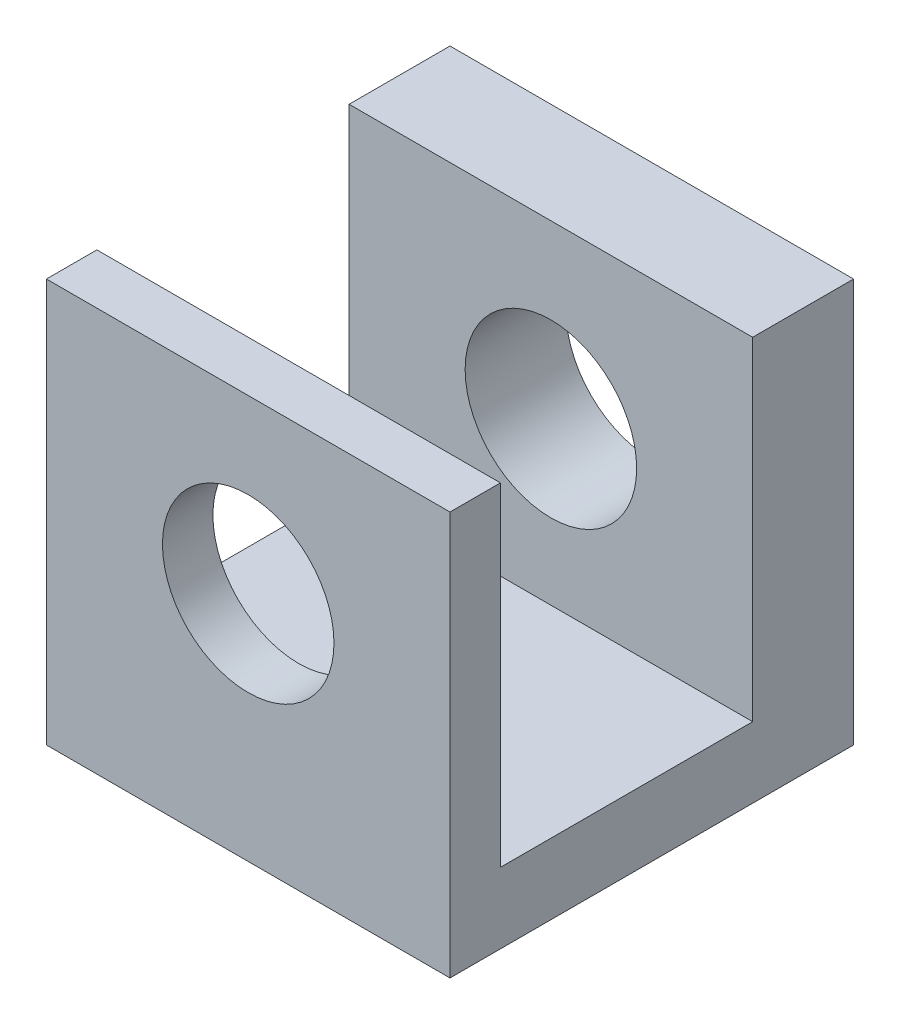
ISO-10303-21;
HEADER;
FILE_DESCRIPTION(('STEP AP214'),'2;1');
FILE_NAME('part.step','',(''),(''),'','','');
FILE_SCHEMA(('AUTOMOTIVE_DESIGN { 1 0 10303 214 1 1 1 1 }'));
ENDSEC;
DATA;
#1=APPLICATION_CONTEXT('core data for automotive mechanical design processes');
#2=APPLICATION_PROTOCOL_DEFINITION('international standard','automotive_design',2000,#1);
#3=PRODUCT_CONTEXT('',#1,'mechanical');
#4=PRODUCT('Part','Part','',(#3));
#5=PRODUCT_RELATED_PRODUCT_CATEGORY('part','',(#4));
#6=PRODUCT_DEFINITION_FORMATION('','',#4);
#7=PRODUCT_DEFINITION_CONTEXT('part definition',#1,'design');
#8=PRODUCT_DEFINITION('design','',#6,#7);
#9=PRODUCT_DEFINITION_SHAPE('','',#8);
#10=(LENGTH_UNIT() NAMED_UNIT(*) SI_UNIT(.MILLI.,.METRE.));
#11=(NAMED_UNIT(*) PLANE_ANGLE_UNIT() SI_UNIT($,.RADIAN.));
#12=(NAMED_UNIT(*) SI_UNIT($,.STERADIAN.) SOLID_ANGLE_UNIT());
#13=UNCERTAINTY_MEASURE_WITH_UNIT(LENGTH_MEASURE(1.E-05),#10,'distance_accuracy_value','');
#14=(GEOMETRIC_REPRESENTATION_CONTEXT(3) GLOBAL_UNCERTAINTY_ASSIGNED_CONTEXT((#13)) GLOBAL_UNIT_ASSIGNED_CONTEXT((#10,
#11,#12)) REPRESENTATION_CONTEXT('',''));
#15=CARTESIAN_POINT('',(0.,0.,0.));
#16=DIRECTION('',(0.,0.,1.));
#17=DIRECTION('',(1.,0.,0.));
#18=AXIS2_PLACEMENT_3D('',#15,#16,#17);
#19=CARTESIAN_POINT('',(20.,20.,-40.));
#20=DIRECTION('',(0.,1.,0.));
#21=DIRECTION('',(-1.,0.,0.));
#22=AXIS2_PLACEMENT_3D('',#19,#20,#21);
#23=PLANE('',#22);
#24=DIRECTION('',(1.,0.,0.));
#25=VECTOR('',#24,1.);
#26=CARTESIAN_POINT('',(-42.5,20.,-5.));
#27=LINE('',#26,#25);
#28=CARTESIAN_POINT('',(-20.,20.,-5.));
#29=VERTEX_POINT('',#28);
#30=CARTESIAN_POINT('',(20.,20.,-5.));
#31=VERTEX_POINT('',#30);
#32=EDGE_CURVE('E136',#29,#31,#27,.T.);
#33=ORIENTED_EDGE('',*,*,#32,.F.);
#34=DIRECTION('',(0.,0.,1.));
#35=VECTOR('',#34,1.);
#36=CARTESIAN_POINT('',(-20.,20.,-40.));
#37=LINE('',#36,#35);
#38=CARTESIAN_POINT('',(-20.,20.,0.));
#39=VERTEX_POINT('',#38);
#40=EDGE_CURVE('E43',#29,#39,#37,.T.);
#41=ORIENTED_EDGE('',*,*,#40,.T.);
#42=DIRECTION('',(-1.,0.,0.));
#43=VECTOR('',#42,1.);
#44=CARTESIAN_POINT('',(20.,20.,0.));
#45=LINE('',#44,#43);
#46=CARTESIAN_POINT('',(20.,20.,0.));
#47=VERTEX_POINT('',#46);
#48=EDGE_CURVE('E148',#47,#39,#45,.T.);
#49=ORIENTED_EDGE('',*,*,#48,.F.);
#50=DIRECTION('',(0.,0.,1.));
#51=VECTOR('',#50,1.);
#52=CARTESIAN_POINT('',(20.,20.,-40.));
#53=LINE('',#52,#51);
#54=EDGE_CURVE('E166',#31,#47,#53,.T.);
#55=ORIENTED_EDGE('',*,*,#54,.F.);
#56=EDGE_LOOP('',(#33,#41,#49,#55));
#57=FACE_BOUND('',#56,.T.);
#58=ADVANCED_FACE('F34',(#57),#23,.T.);
#59=CARTESIAN_POINT('',(-20.,-20.,-40.));
#60=DIRECTION('',(-1.,0.,0.));
#61=DIRECTION('',(0.,0.,1.));
#62=AXIS2_PLACEMENT_3D('',#59,#60,#61);
#63=PLANE('',#62);
#64=DIRECTION('',(0.,1.,0.));
#65=VECTOR('',#64,1.);
#66=CARTESIAN_POINT('',(-20.,-20.,-5.));
#67=LINE('',#66,#65);
#68=CARTESIAN_POINT('',(-20.,-13.,-5.));
#69=VERTEX_POINT('',#68);
#70=EDGE_CURVE('E142',#69,#29,#67,.T.);
#71=ORIENTED_EDGE('',*,*,#70,.F.);
#72=DIRECTION('',(0.,0.,1.));
#73=VECTOR('',#72,1.);
#74=CARTESIAN_POINT('',(-20.,-13.,-40.));
#75=LINE('',#74,#73);
#76=CARTESIAN_POINT('',(-20.,-13.,-30.));
#77=VERTEX_POINT('',#76);
#78=EDGE_CURVE('E138',#77,#69,#75,.T.);
#79=ORIENTED_EDGE('',*,*,#78,.F.);
#80=DIRECTION('',(0.,-1.,0.));
#81=VECTOR('',#80,1.);
#82=CARTESIAN_POINT('',(-20.,-20.,-30.));
#83=LINE('',#82,#81);
#84=CARTESIAN_POINT('',(-20.,20.,-30.));
#85=VERTEX_POINT('',#84);
#86=EDGE_CURVE('E117',#85,#77,#83,.T.);
#87=ORIENTED_EDGE('',*,*,#86,.F.);
#88=CARTESIAN_POINT('',(-20.,20.,-40.));
#89=VERTEX_POINT('',#88);
#90=EDGE_CURVE('E11',#89,#85,#37,.T.);
#91=ORIENTED_EDGE('',*,*,#90,.F.);
#92=DIRECTION('',(0.,-1.,0.));
#93=VECTOR('',#92,1.);
#94=CARTESIAN_POINT('',(-20.,-20.,-40.));
#95=LINE('',#94,#93);
#96=CARTESIAN_POINT('',(-20.,-20.,-40.));
#97=VERTEX_POINT('',#96);
#98=EDGE_CURVE('E145',#89,#97,#95,.T.);
#99=ORIENTED_EDGE('',*,*,#98,.T.);
#100=DIRECTION('',(0.,0.,1.));
#101=VECTOR('',#100,1.);
#102=CARTESIAN_POINT('',(-20.,-20.,-40.));
#103=LINE('',#102,#101);
#104=CARTESIAN_POINT('',(-20.,-20.,0.));
#105=VERTEX_POINT('',#104);
#106=EDGE_CURVE('E87',#97,#105,#103,.T.);
#107=ORIENTED_EDGE('',*,*,#106,.T.);
#108=DIRECTION('',(0.,-1.,0.));
#109=VECTOR('',#108,1.);
#110=CARTESIAN_POINT('',(-20.,-20.,0.));
#111=LINE('',#110,#109);
#112=EDGE_CURVE('E144',#39,#105,#111,.T.);
#113=ORIENTED_EDGE('',*,*,#112,.F.);
#114=ORIENTED_EDGE('',*,*,#40,.F.);
#115=EDGE_LOOP('',(#71,#79,#87,#91,#99,#107,#113,#114));
#116=FACE_BOUND('',#115,.T.);
#117=ADVANCED_FACE('F36',(#116),#63,.T.);
#118=DIRECTION('',(1.,0.,0.));
#119=VECTOR('',#118,1.);
#120=CARTESIAN_POINT('',(-42.5,20.,-30.));
#121=LINE('',#120,#119);
#122=CARTESIAN_POINT('',(20.,20.,-30.));
#123=VERTEX_POINT('',#122);
#124=EDGE_CURVE('E120',#85,#123,#121,.T.);
#125=ORIENTED_EDGE('',*,*,#124,.T.);
#126=CARTESIAN_POINT('',(20.,20.,-40.));
#127=VERTEX_POINT('',#126);
#128=EDGE_CURVE('E131',#127,#123,#53,.T.);
#129=ORIENTED_EDGE('',*,*,#128,.F.);
#130=DIRECTION('',(-1.,0.,0.));
#131=VECTOR('',#130,1.);
#132=CARTESIAN_POINT('',(20.,20.,-40.));
#133=LINE('',#132,#131);
#134=EDGE_CURVE('E152',#127,#89,#133,.T.);
#135=ORIENTED_EDGE('',*,*,#134,.T.);
#136=ORIENTED_EDGE('',*,*,#90,.T.);
#137=EDGE_LOOP('',(#125,#129,#135,#136));
#138=FACE_BOUND('',#137,.T.);
#139=ADVANCED_FACE('F203',(#138),#23,.T.);
#140=CARTESIAN_POINT('',(20.,-20.,-40.));
#141=DIRECTION('',(1.,0.,0.));
#142=DIRECTION('',(0.,0.,-1.));
#143=AXIS2_PLACEMENT_3D('',#140,#141,#142);
#144=PLANE('',#143);
#145=DIRECTION('',(0.,-1.,0.));
#146=VECTOR('',#145,1.);
#147=CARTESIAN_POINT('',(20.,-13.,-5.));
#148=LINE('',#147,#146);
#149=CARTESIAN_POINT('',(20.,-13.,-5.));
#150=VERTEX_POINT('',#149);
#151=EDGE_CURVE('E51',#31,#150,#148,.T.);
#152=ORIENTED_EDGE('',*,*,#151,.F.);
#153=ORIENTED_EDGE('',*,*,#54,.T.);
#154=DIRECTION('',(0.,1.,0.));
#155=VECTOR('',#154,1.);
#156=CARTESIAN_POINT('',(20.,-20.,0.));
#157=LINE('',#156,#155);
#158=CARTESIAN_POINT('',(20.,-20.,0.));
#159=VERTEX_POINT('',#158);
#160=EDGE_CURVE('E160',#159,#47,#157,.T.);
#161=ORIENTED_EDGE('',*,*,#160,.F.);
#162=DIRECTION('',(0.,0.,1.));
#163=VECTOR('',#162,1.);
#164=CARTESIAN_POINT('',(20.,-20.,-40.));
#165=LINE('',#164,#163);
#166=CARTESIAN_POINT('',(20.,-20.,-40.));
#167=VERTEX_POINT('',#166);
#168=EDGE_CURVE('E167',#167,#159,#165,.T.);
#169=ORIENTED_EDGE('',*,*,#168,.F.);
#170=DIRECTION('',(0.,1.,0.));
#171=VECTOR('',#170,1.);
#172=CARTESIAN_POINT('',(20.,-20.,-40.));
#173=LINE('',#172,#171);
#174=EDGE_CURVE('E150',#167,#127,#173,.T.);
#175=ORIENTED_EDGE('',*,*,#174,.T.);
#176=ORIENTED_EDGE('',*,*,#128,.T.);
#177=DIRECTION('',(0.,1.,0.));
#178=VECTOR('',#177,1.);
#179=CARTESIAN_POINT('',(20.,-13.,-30.));
#180=LINE('',#179,#178);
#181=CARTESIAN_POINT('',(20.,-13.,-30.));
#182=VERTEX_POINT('',#181);
#183=EDGE_CURVE('E115',#182,#123,#180,.T.);
#184=ORIENTED_EDGE('',*,*,#183,.F.);
#185=DIRECTION('',(0.,0.,-1.));
#186=VECTOR('',#185,1.);
#187=CARTESIAN_POINT('',(20.,-13.,-30.));
#188=LINE('',#187,#186);
#189=EDGE_CURVE('E124',#150,#182,#188,.T.);
#190=ORIENTED_EDGE('',*,*,#189,.F.);
#191=EDGE_LOOP('',(#152,#153,#161,#169,#175,#176,#184,#190));
#192=FACE_BOUND('',#191,.T.);
#193=ADVANCED_FACE('F129',(#192),#144,.T.);
#194=CARTESIAN_POINT('',(20.,-20.,-40.));
#195=DIRECTION('',(0.,-1.,0.));
#196=DIRECTION('',(1.,0.,0.));
#197=AXIS2_PLACEMENT_3D('',#194,#195,#196);
#198=PLANE('',#197);
#199=DIRECTION('',(1.,0.,0.));
#200=VECTOR('',#199,1.);
#201=CARTESIAN_POINT('',(20.,-20.,0.));
#202=LINE('',#201,#200);
#203=EDGE_CURVE('E157',#105,#159,#202,.T.);
#204=ORIENTED_EDGE('',*,*,#203,.F.);
#205=ORIENTED_EDGE('',*,*,#106,.F.);
#206=DIRECTION('',(1.,0.,0.));
#207=VECTOR('',#206,1.);
#208=CARTESIAN_POINT('',(20.,-20.,-40.));
#209=LINE('',#208,#207);
#210=EDGE_CURVE('E147',#97,#167,#209,.T.);
#211=ORIENTED_EDGE('',*,*,#210,.T.);
#212=ORIENTED_EDGE('',*,*,#168,.T.);
#213=EDGE_LOOP('',(#204,#205,#211,#212));
#214=FACE_BOUND('',#213,.T.);
#215=ADVANCED_FACE('F169',(#214),#198,.T.);
#216=CARTESIAN_POINT('',(0.,0.,-40.));
#217=DIRECTION('',(0.,0.,1.));
#218=DIRECTION('',(1.,0.,0.));
#219=AXIS2_PLACEMENT_3D('',#216,#217,#218);
#220=PLANE('',#219);
#221=CARTESIAN_POINT('',(0.,2.99429003852936,-40.));
#222=DIRECTION('',(0.,0.,1.));
#223=DIRECTION('',(1.,0.,0.));
#224=AXIS2_PLACEMENT_3D('',#221,#222,#223);
#225=CIRCLE('',#224,8.5);
#226=CARTESIAN_POINT('',(8.5,2.99429003852936,-40.));
#227=VERTEX_POINT('',#226);
#228=EDGE_CURVE('E174',#227,#227,#225,.T.);
#229=ORIENTED_EDGE('',*,*,#228,.T.);
#230=EDGE_LOOP('',(#229));
#231=FACE_BOUND('',#230,.T.);
#232=ORIENTED_EDGE('',*,*,#98,.F.);
#233=ORIENTED_EDGE('',*,*,#134,.F.);
#234=ORIENTED_EDGE('',*,*,#174,.F.);
#235=ORIENTED_EDGE('',*,*,#210,.F.);
#236=EDGE_LOOP('',(#232,#233,#234,#235));
#237=FACE_BOUND('',#236,.T.);
#238=ADVANCED_FACE('F196',(#231,#237),#220,.F.);
#239=CARTESIAN_POINT('',(0.,0.,0.));
#240=DIRECTION('',(0.,0.,1.));
#241=DIRECTION('',(1.,0.,0.));
#242=AXIS2_PLACEMENT_3D('',#239,#240,#241);
#243=PLANE('',#242);
#244=CARTESIAN_POINT('',(0.,2.99429003852936,0.));
#245=DIRECTION('',(0.,0.,1.));
#246=DIRECTION('',(1.,0.,0.));
#247=AXIS2_PLACEMENT_3D('',#244,#245,#246);
#248=CIRCLE('',#247,8.5);
#249=CARTESIAN_POINT('',(8.5,2.99429003852936,0.));
#250=VERTEX_POINT('',#249);
#251=EDGE_CURVE('E181',#250,#250,#248,.T.);
#252=ORIENTED_EDGE('',*,*,#251,.F.);
#253=EDGE_LOOP('',(#252));
#254=FACE_BOUND('',#253,.T.);
#255=ORIENTED_EDGE('',*,*,#112,.T.);
#256=ORIENTED_EDGE('',*,*,#203,.T.);
#257=ORIENTED_EDGE('',*,*,#160,.T.);
#258=ORIENTED_EDGE('',*,*,#48,.T.);
#259=EDGE_LOOP('',(#255,#256,#257,#258));
#260=FACE_BOUND('',#259,.T.);
#261=ADVANCED_FACE('F172',(#254,#260),#243,.T.);
#262=CARTESIAN_POINT('',(-42.5,-13.,-5.));
#263=DIRECTION('',(0.,0.,1.));
#264=DIRECTION('',(0.,-1.,0.));
#265=AXIS2_PLACEMENT_3D('',#262,#263,#264);
#266=PLANE('',#265);
#267=CARTESIAN_POINT('',(0.,2.99429003852936,-5.));
#268=DIRECTION('',(0.,0.,1.));
#269=DIRECTION('',(0.,-1.,0.));
#270=AXIS2_PLACEMENT_3D('',#267,#268,#269);
#271=CIRCLE('',#270,8.5);
#272=CARTESIAN_POINT('',(0.,-5.50570996147064,-5.00000000000001));
#273=VERTEX_POINT('',#272);
#274=EDGE_CURVE('E176',#273,#273,#271,.T.);
#275=ORIENTED_EDGE('',*,*,#274,.T.);
#276=EDGE_LOOP('',(#275));
#277=FACE_BOUND('',#276,.T.);
#278=ORIENTED_EDGE('',*,*,#70,.T.);
#279=ORIENTED_EDGE('',*,*,#32,.T.);
#280=ORIENTED_EDGE('',*,*,#151,.T.);
#281=DIRECTION('',(1.,0.,0.));
#282=VECTOR('',#281,1.);
#283=CARTESIAN_POINT('',(-42.5,-13.,-5.));
#284=LINE('',#283,#282);
#285=EDGE_CURVE('E121',#69,#150,#284,.T.);
#286=ORIENTED_EDGE('',*,*,#285,.F.);
#287=EDGE_LOOP('',(#278,#279,#280,#286));
#288=FACE_BOUND('',#287,.T.);
#289=ADVANCED_FACE('F204',(#277,#288),#266,.F.);
#290=CARTESIAN_POINT('',(-42.5,-13.,-30.));
#291=DIRECTION('',(0.,0.,-1.));
#292=DIRECTION('',(-1.,0.,0.));
#293=AXIS2_PLACEMENT_3D('',#290,#291,#292);
#294=PLANE('',#293);
#295=CARTESIAN_POINT('',(0.,2.99429003852936,-30.));
#296=DIRECTION('',(0.,0.,-1.));
#297=DIRECTION('',(-1.,0.,0.));
#298=AXIS2_PLACEMENT_3D('',#295,#296,#297);
#299=CIRCLE('',#298,8.5);
#300=CARTESIAN_POINT('',(-8.5,2.99429003852936,-30.));
#301=VERTEX_POINT('',#300);
#302=EDGE_CURVE('E38',#301,#301,#299,.T.);
#303=ORIENTED_EDGE('',*,*,#302,.T.);
#304=EDGE_LOOP('',(#303));
#305=FACE_BOUND('',#304,.T.);
#306=ORIENTED_EDGE('',*,*,#86,.T.);
#307=DIRECTION('',(1.,0.,0.));
#308=VECTOR('',#307,1.);
#309=CARTESIAN_POINT('',(-42.5,-13.,-30.));
#310=LINE('',#309,#308);
#311=EDGE_CURVE('E111',#77,#182,#310,.T.);
#312=ORIENTED_EDGE('',*,*,#311,.T.);
#313=ORIENTED_EDGE('',*,*,#183,.T.);
#314=ORIENTED_EDGE('',*,*,#124,.F.);
#315=EDGE_LOOP('',(#306,#312,#313,#314));
#316=FACE_BOUND('',#315,.T.);
#317=ADVANCED_FACE('F113',(#305,#316),#294,.F.);
#318=CARTESIAN_POINT('',(-42.5,-13.,-30.));
#319=DIRECTION('',(0.,-1.,0.));
#320=DIRECTION('',(0.,0.,-1.));
#321=AXIS2_PLACEMENT_3D('',#318,#319,#320);
#322=PLANE('',#321);
#323=ORIENTED_EDGE('',*,*,#78,.T.);
#324=ORIENTED_EDGE('',*,*,#285,.T.);
#325=ORIENTED_EDGE('',*,*,#189,.T.);
#326=ORIENTED_EDGE('',*,*,#311,.F.);
#327=EDGE_LOOP('',(#323,#324,#325,#326));
#328=FACE_BOUND('',#327,.T.);
#329=ADVANCED_FACE('F125',(#328),#322,.F.);
#330=CARTESIAN_POINT('',(0.,2.99429003852936,-62.5));
#331=DIRECTION('',(0.,0.,1.));
#332=DIRECTION('',(1.,0.,0.));
#333=AXIS2_PLACEMENT_3D('',#330,#331,#332);
#334=CYLINDRICAL_SURFACE('',#333,8.5);
#335=ORIENTED_EDGE('',*,*,#302,.F.);
#336=EDGE_LOOP('',(#335));
#337=FACE_BOUND('',#336,.T.);
#338=ORIENTED_EDGE('',*,*,#228,.F.);
#339=EDGE_LOOP('',(#338));
#340=FACE_BOUND('',#339,.T.);
#341=ADVANCED_FACE('F189',(#337,#340),#334,.F.);
#342=ORIENTED_EDGE('',*,*,#251,.T.);
#343=EDGE_LOOP('',(#342));
#344=FACE_BOUND('',#343,.T.);
#345=ORIENTED_EDGE('',*,*,#274,.F.);
#346=EDGE_LOOP('',(#345));
#347=FACE_BOUND('',#346,.T.);
#348=ADVANCED_FACE('F192',(#344,#347),#334,.F.);
#349=CLOSED_SHELL('',(#58,#117,#139,#193,#215,#238,#261,#289,#317,#329,#341,#348));
#350=MANIFOLD_SOLID_BREP('B2',#349);
#351=ADVANCED_BREP_SHAPE_REPRESENTATION('',(#18,#350),#14);
#352=SHAPE_DEFINITION_REPRESENTATION(#9,#351);
ENDSEC;
END-ISO-10303-21;
